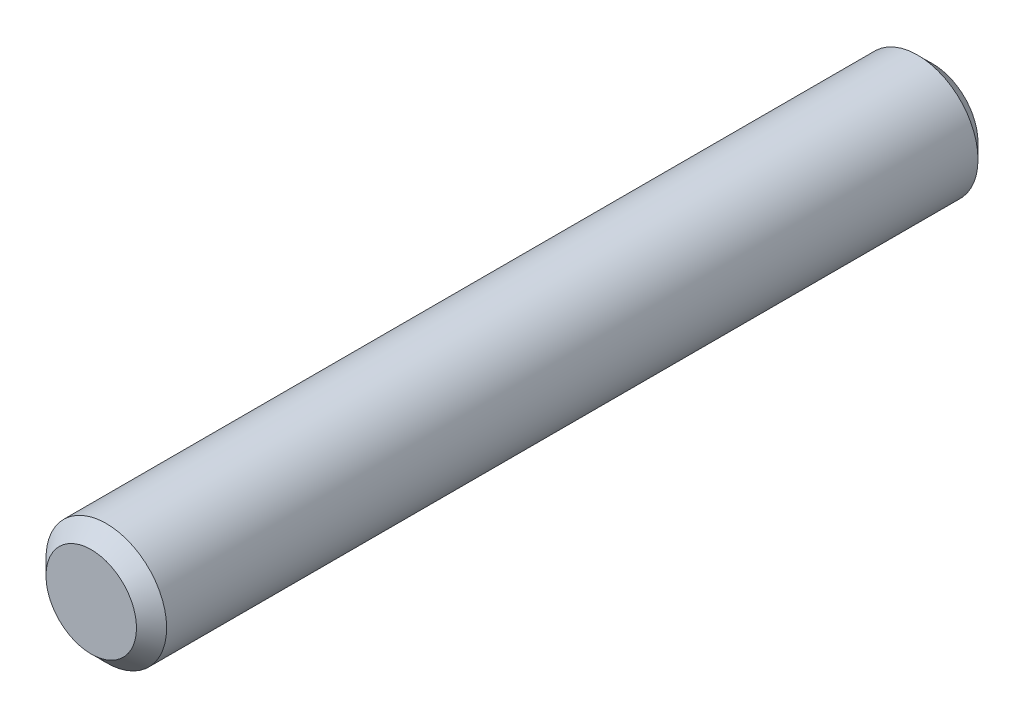
ISO-10303-21;
HEADER;
FILE_DESCRIPTION(('STEP AP214'),'2;1');
FILE_NAME('part.step','',(''),(''),'','','');
FILE_SCHEMA(('AUTOMOTIVE_DESIGN { 1 0 10303 214 1 1 1 1 }'));
ENDSEC;
DATA;
#1=APPLICATION_CONTEXT('core data for automotive mechanical design processes');
#2=APPLICATION_PROTOCOL_DEFINITION('international standard','automotive_design',2000,#1);
#3=PRODUCT_CONTEXT('',#1,'mechanical');
#4=PRODUCT('Part','Part','',(#3));
#5=PRODUCT_RELATED_PRODUCT_CATEGORY('part','',(#4));
#6=PRODUCT_DEFINITION_FORMATION('','',#4);
#7=PRODUCT_DEFINITION_CONTEXT('part definition',#1,'design');
#8=PRODUCT_DEFINITION('design','',#6,#7);
#9=PRODUCT_DEFINITION_SHAPE('','',#8);
#10=(LENGTH_UNIT() NAMED_UNIT(*) SI_UNIT(.MILLI.,.METRE.));
#11=(NAMED_UNIT(*) PLANE_ANGLE_UNIT() SI_UNIT($,.RADIAN.));
#12=(NAMED_UNIT(*) SI_UNIT($,.STERADIAN.) SOLID_ANGLE_UNIT());
#13=UNCERTAINTY_MEASURE_WITH_UNIT(LENGTH_MEASURE(1.E-05),#10,'distance_accuracy_value','');
#14=(GEOMETRIC_REPRESENTATION_CONTEXT(3) GLOBAL_UNCERTAINTY_ASSIGNED_CONTEXT((#13)) GLOBAL_UNIT_ASSIGNED_CONTEXT((#10,
#11,#12)) REPRESENTATION_CONTEXT('',''));
#15=CARTESIAN_POINT('',(0.,0.,0.));
#16=DIRECTION('',(0.,0.,1.));
#17=DIRECTION('',(1.,0.,0.));
#18=AXIS2_PLACEMENT_3D('',#15,#16,#17);
#19=CARTESIAN_POINT('',(0.,0.,-35.433));
#20=DIRECTION('',(0.,0.,1.));
#21=DIRECTION('',(1.,0.,0.));
#22=AXIS2_PLACEMENT_3D('',#19,#20,#21);
#23=CYLINDRICAL_SURFACE('',#22,5.08);
#24=CARTESIAN_POINT('',(0.,0.,34.163));
#25=DIRECTION('',(0.,0.,1.));
#26=DIRECTION('',(1.,0.,0.));
#27=AXIS2_PLACEMENT_3D('',#24,#25,#26);
#28=CIRCLE('',#27,5.08);
#29=CARTESIAN_POINT('',(5.08,0.,34.163));
#30=VERTEX_POINT('',#29);
#31=EDGE_CURVE('E38',#30,#30,#28,.F.);
#32=ORIENTED_EDGE('',*,*,#31,.T.);
#33=EDGE_LOOP('',(#32));
#34=FACE_BOUND('',#33,.T.);
#35=CARTESIAN_POINT('',(0.,0.,-34.163));
#36=DIRECTION('',(0.,0.,1.));
#37=DIRECTION('',(1.,0.,0.));
#38=AXIS2_PLACEMENT_3D('',#35,#36,#37);
#39=CIRCLE('',#38,5.08);
#40=CARTESIAN_POINT('',(5.08,0.,-34.163));
#41=VERTEX_POINT('',#40);
#42=EDGE_CURVE('E42',#41,#41,#39,.T.);
#43=ORIENTED_EDGE('',*,*,#42,.T.);
#44=EDGE_LOOP('',(#43));
#45=FACE_BOUND('',#44,.T.);
#46=ADVANCED_FACE('F31',(#34,#45),#23,.T.);
#47=CARTESIAN_POINT('',(0.,0.,-35.433));
#48=DIRECTION('',(0.,0.,1.));
#49=DIRECTION('',(1.,0.,0.));
#50=AXIS2_PLACEMENT_3D('',#47,#48,#49);
#51=PLANE('',#50);
#52=CARTESIAN_POINT('',(0.,0.,-35.433));
#53=DIRECTION('',(0.,0.,1.));
#54=DIRECTION('',(1.,0.,0.));
#55=AXIS2_PLACEMENT_3D('',#52,#53,#54);
#56=CIRCLE('',#55,3.81);
#57=CARTESIAN_POINT('',(3.81,0.,-35.433));
#58=VERTEX_POINT('',#57);
#59=EDGE_CURVE('E10',#58,#58,#56,.F.);
#60=ORIENTED_EDGE('',*,*,#59,.T.);
#61=EDGE_LOOP('',(#60));
#62=FACE_BOUND('',#61,.T.);
#63=ADVANCED_FACE('F62',(#62),#51,.F.);
#64=CARTESIAN_POINT('',(0.,0.,35.433));
#65=DIRECTION('',(0.,0.,1.));
#66=DIRECTION('',(1.,0.,0.));
#67=AXIS2_PLACEMENT_3D('',#64,#65,#66);
#68=PLANE('',#67);
#69=CARTESIAN_POINT('',(0.,0.,35.433));
#70=DIRECTION('',(0.,0.,1.));
#71=DIRECTION('',(1.,0.,0.));
#72=AXIS2_PLACEMENT_3D('',#69,#70,#71);
#73=CIRCLE('',#72,3.81);
#74=CARTESIAN_POINT('',(3.81,0.,35.433));
#75=VERTEX_POINT('',#74);
#76=EDGE_CURVE('E46',#75,#75,#73,.T.);
#77=ORIENTED_EDGE('',*,*,#76,.T.);
#78=EDGE_LOOP('',(#77));
#79=FACE_BOUND('',#78,.T.);
#80=ADVANCED_FACE('F52',(#79),#68,.T.);
#81=CARTESIAN_POINT('',(0.,0.,35.433));
#82=DIRECTION('',(0.,0.,-1.));
#83=DIRECTION('',(-1.,0.,0.));
#84=AXIS2_PLACEMENT_3D('',#81,#82,#83);
#85=CONICAL_SURFACE('',#84,3.81,0.785398163397445);
#86=ORIENTED_EDGE('',*,*,#31,.F.);
#87=EDGE_LOOP('',(#86));
#88=FACE_BOUND('',#87,.T.);
#89=ORIENTED_EDGE('',*,*,#76,.F.);
#90=EDGE_LOOP('',(#89));
#91=FACE_BOUND('',#90,.T.);
#92=ADVANCED_FACE('F54',(#88,#91),#85,.T.);
#93=CARTESIAN_POINT('',(0.,0.,-34.163));
#94=DIRECTION('',(0.,0.,1.));
#95=DIRECTION('',(1.,0.,0.));
#96=AXIS2_PLACEMENT_3D('',#93,#94,#95);
#97=CONICAL_SURFACE('',#96,5.08,0.785398163397453);
#98=ORIENTED_EDGE('',*,*,#59,.F.);
#99=EDGE_LOOP('',(#98));
#100=FACE_BOUND('',#99,.T.);
#101=ORIENTED_EDGE('',*,*,#42,.F.);
#102=EDGE_LOOP('',(#101));
#103=FACE_BOUND('',#102,.T.);
#104=ADVANCED_FACE('F33',(#100,#103),#97,.T.);
#105=CLOSED_SHELL('',(#46,#63,#80,#92,#104));
#106=MANIFOLD_SOLID_BREP('B2',#105);
#107=ADVANCED_BREP_SHAPE_REPRESENTATION('',(#18,#106),#14);
#108=SHAPE_DEFINITION_REPRESENTATION(#9,#107);
ENDSEC;
END-ISO-10303-21;
